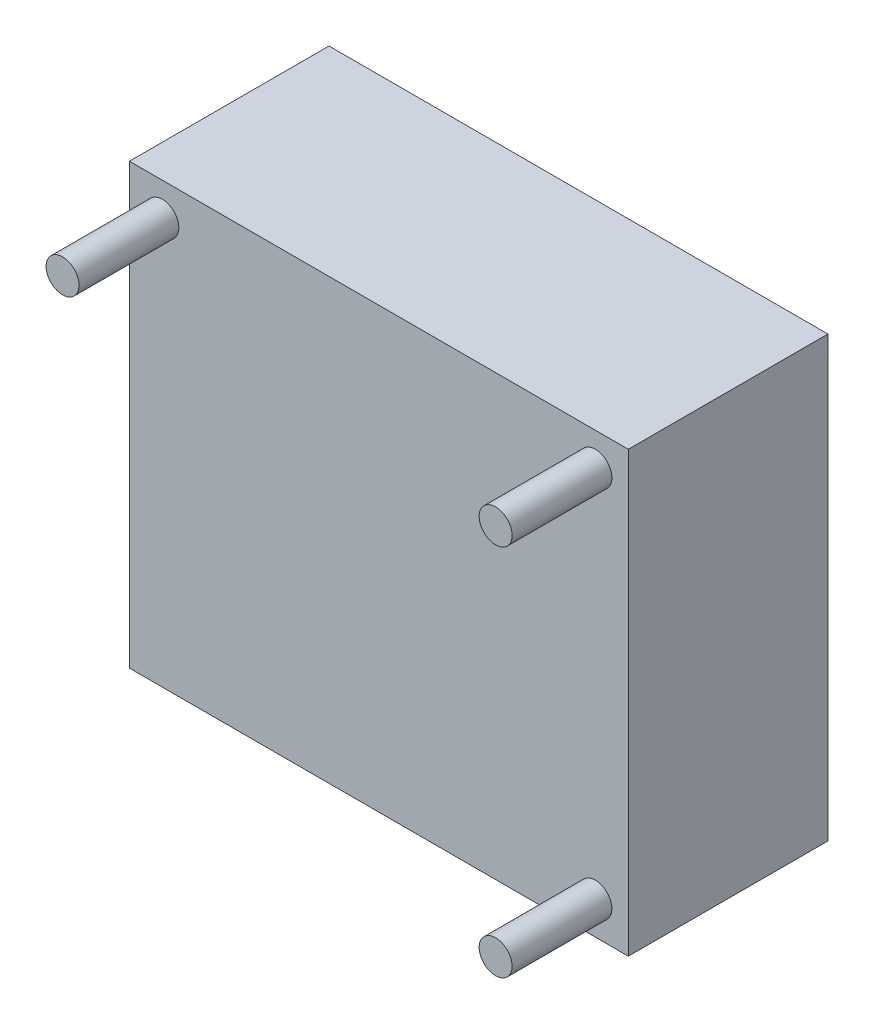
ISO-10303-21;
HEADER;
FILE_DESCRIPTION(('STEP AP214'),'2;1');
FILE_NAME('part.step','',(''),(''),'','','');
FILE_SCHEMA(('AUTOMOTIVE_DESIGN { 1 0 10303 214 1 1 1 1 }'));
ENDSEC;
DATA;
#1=APPLICATION_CONTEXT('core data for automotive mechanical design processes');
#2=APPLICATION_PROTOCOL_DEFINITION('international standard','automotive_design',2000,#1);
#3=PRODUCT_CONTEXT('',#1,'mechanical');
#4=PRODUCT('Part','Part','',(#3));
#5=PRODUCT_RELATED_PRODUCT_CATEGORY('part','',(#4));
#6=PRODUCT_DEFINITION_FORMATION('','',#4);
#7=PRODUCT_DEFINITION_CONTEXT('part definition',#1,'design');
#8=PRODUCT_DEFINITION('design','',#6,#7);
#9=PRODUCT_DEFINITION_SHAPE('','',#8);
#10=(LENGTH_UNIT() NAMED_UNIT(*) SI_UNIT(.MILLI.,.METRE.));
#11=(NAMED_UNIT(*) PLANE_ANGLE_UNIT() SI_UNIT($,.RADIAN.));
#12=(NAMED_UNIT(*) SI_UNIT($,.STERADIAN.) SOLID_ANGLE_UNIT());
#13=UNCERTAINTY_MEASURE_WITH_UNIT(LENGTH_MEASURE(1.E-05),#10,'distance_accuracy_value','');
#14=(GEOMETRIC_REPRESENTATION_CONTEXT(3) GLOBAL_UNCERTAINTY_ASSIGNED_CONTEXT((#13)) GLOBAL_UNIT_ASSIGNED_CONTEXT((#10,
#11,#12)) REPRESENTATION_CONTEXT('',''));
#15=CARTESIAN_POINT('',(0.,0.,0.));
#16=DIRECTION('',(0.,0.,1.));
#17=DIRECTION('',(1.,0.,0.));
#18=AXIS2_PLACEMENT_3D('',#15,#16,#17);
#19=CARTESIAN_POINT('',(3.3,40.7,30.));
#20=DIRECTION('',(0.,0.,-1.));
#21=DIRECTION('',(-1.,0.,0.));
#22=AXIS2_PLACEMENT_3D('',#19,#20,#21);
#23=CYLINDRICAL_SURFACE('',#22,1.65);
#24=CARTESIAN_POINT('',(3.3,40.7,30.));
#25=DIRECTION('',(0.,0.,-1.));
#26=DIRECTION('',(-1.,0.,0.));
#27=AXIS2_PLACEMENT_3D('',#24,#25,#26);
#28=CIRCLE('',#27,1.65);
#29=CARTESIAN_POINT('',(1.65,40.7,30.));
#30=VERTEX_POINT('',#29);
#31=EDGE_CURVE('E11',#30,#30,#28,.T.);
#32=ORIENTED_EDGE('',*,*,#31,.T.);
#33=EDGE_LOOP('',(#32));
#34=FACE_BOUND('',#33,.T.);
#35=CARTESIAN_POINT('',(3.3,40.7,0.));
#36=DIRECTION('',(0.,0.,-1.));
#37=DIRECTION('',(-1.,0.,0.));
#38=AXIS2_PLACEMENT_3D('',#35,#36,#37);
#39=CIRCLE('',#38,1.65);
#40=CARTESIAN_POINT('',(1.65,40.7,0.));
#41=VERTEX_POINT('',#40);
#42=EDGE_CURVE('E43',#41,#41,#39,.T.);
#43=ORIENTED_EDGE('',*,*,#42,.F.);
#44=EDGE_LOOP('',(#43));
#45=FACE_BOUND('',#44,.T.);
#46=ADVANCED_FACE('F40',(#34,#45),#23,.T.);
#47=CARTESIAN_POINT('',(3.3,40.7,30.));
#48=DIRECTION('',(0.,0.,-1.));
#49=DIRECTION('',(-1.,0.,0.));
#50=AXIS2_PLACEMENT_3D('',#47,#48,#49);
#51=PLANE('',#50);
#52=ORIENTED_EDGE('',*,*,#31,.F.);
#53=EDGE_LOOP('',(#52));
#54=FACE_BOUND('',#53,.T.);
#55=ADVANCED_FACE('F55',(#54),#51,.F.);
#56=CARTESIAN_POINT('',(3.3,40.7,0.));
#57=DIRECTION('',(0.,0.,-1.));
#58=DIRECTION('',(-1.,0.,0.));
#59=AXIS2_PLACEMENT_3D('',#56,#57,#58);
#60=PLANE('',#59);
#61=ORIENTED_EDGE('',*,*,#42,.T.);
#62=EDGE_LOOP('',(#61));
#63=FACE_BOUND('',#62,.T.);
#64=ADVANCED_FACE('F52',(#63),#60,.T.);
#65=CLOSED_SHELL('',(#46,#55,#64));
#66=MANIFOLD_SOLID_BREP('B2',#65);
#67=CARTESIAN_POINT('',(46.7,3.3,30.));
#68=DIRECTION('',(0.,0.,-1.));
#69=DIRECTION('',(-1.,0.,0.));
#70=AXIS2_PLACEMENT_3D('',#67,#68,#69);
#71=CYLINDRICAL_SURFACE('',#70,1.65);
#72=CARTESIAN_POINT('',(46.7,3.3,30.));
#73=DIRECTION('',(0.,0.,-1.));
#74=DIRECTION('',(-1.,0.,0.));
#75=AXIS2_PLACEMENT_3D('',#72,#73,#74);
#76=CIRCLE('',#75,1.65);
#77=CARTESIAN_POINT('',(45.05,3.3,30.));
#78=VERTEX_POINT('',#77);
#79=EDGE_CURVE('E39',#78,#78,#76,.T.);
#80=ORIENTED_EDGE('',*,*,#79,.T.);
#81=EDGE_LOOP('',(#80));
#82=FACE_BOUND('',#81,.T.);
#83=CARTESIAN_POINT('',(46.7,3.3,0.));
#84=DIRECTION('',(0.,0.,-1.));
#85=DIRECTION('',(-1.,0.,0.));
#86=AXIS2_PLACEMENT_3D('',#83,#84,#85);
#87=CIRCLE('',#86,1.65);
#88=CARTESIAN_POINT('',(45.05,3.3,0.));
#89=VERTEX_POINT('',#88);
#90=EDGE_CURVE('E92',#89,#89,#87,.T.);
#91=ORIENTED_EDGE('',*,*,#90,.F.);
#92=EDGE_LOOP('',(#91));
#93=FACE_BOUND('',#92,.T.);
#94=ADVANCED_FACE('F89',(#82,#93),#71,.T.);
#95=CARTESIAN_POINT('',(46.7,3.3,30.));
#96=DIRECTION('',(0.,0.,-1.));
#97=DIRECTION('',(-1.,0.,0.));
#98=AXIS2_PLACEMENT_3D('',#95,#96,#97);
#99=PLANE('',#98);
#100=ORIENTED_EDGE('',*,*,#79,.F.);
#101=EDGE_LOOP('',(#100));
#102=FACE_BOUND('',#101,.T.);
#103=ADVANCED_FACE('F104',(#102),#99,.F.);
#104=CARTESIAN_POINT('',(46.7,3.3,0.));
#105=DIRECTION('',(0.,0.,-1.));
#106=DIRECTION('',(-1.,0.,0.));
#107=AXIS2_PLACEMENT_3D('',#104,#105,#106);
#108=PLANE('',#107);
#109=ORIENTED_EDGE('',*,*,#90,.T.);
#110=EDGE_LOOP('',(#109));
#111=FACE_BOUND('',#110,.T.);
#112=ADVANCED_FACE('F101',(#111),#108,.T.);
#113=CLOSED_SHELL('',(#94,#103,#112));
#114=MANIFOLD_SOLID_BREP('B6',#113);
#115=CARTESIAN_POINT('',(46.7,40.7,30.));
#116=DIRECTION('',(0.,0.,-1.));
#117=DIRECTION('',(-1.,0.,0.));
#118=AXIS2_PLACEMENT_3D('',#115,#116,#117);
#119=CYLINDRICAL_SURFACE('',#118,1.65);
#120=CARTESIAN_POINT('',(46.7,40.7,30.));
#121=DIRECTION('',(0.,0.,-1.));
#122=DIRECTION('',(-1.,0.,0.));
#123=AXIS2_PLACEMENT_3D('',#120,#121,#122);
#124=CIRCLE('',#123,1.65);
#125=CARTESIAN_POINT('',(45.05,40.7,30.));
#126=VERTEX_POINT('',#125);
#127=EDGE_CURVE('E88',#126,#126,#124,.T.);
#128=ORIENTED_EDGE('',*,*,#127,.T.);
#129=EDGE_LOOP('',(#128));
#130=FACE_BOUND('',#129,.T.);
#131=CARTESIAN_POINT('',(46.7,40.7,0.));
#132=DIRECTION('',(0.,0.,-1.));
#133=DIRECTION('',(-1.,0.,0.));
#134=AXIS2_PLACEMENT_3D('',#131,#132,#133);
#135=CIRCLE('',#134,1.65);
#136=CARTESIAN_POINT('',(45.05,40.7,0.));
#137=VERTEX_POINT('',#136);
#138=EDGE_CURVE('E142',#137,#137,#135,.T.);
#139=ORIENTED_EDGE('',*,*,#138,.F.);
#140=EDGE_LOOP('',(#139));
#141=FACE_BOUND('',#140,.T.);
#142=ADVANCED_FACE('F139',(#130,#141),#119,.T.);
#143=CARTESIAN_POINT('',(46.7,40.7,30.));
#144=DIRECTION('',(0.,0.,-1.));
#145=DIRECTION('',(-1.,0.,0.));
#146=AXIS2_PLACEMENT_3D('',#143,#144,#145);
#147=PLANE('',#146);
#148=ORIENTED_EDGE('',*,*,#127,.F.);
#149=EDGE_LOOP('',(#148));
#150=FACE_BOUND('',#149,.T.);
#151=ADVANCED_FACE('F154',(#150),#147,.F.);
#152=CARTESIAN_POINT('',(46.7,40.7,0.));
#153=DIRECTION('',(0.,0.,-1.));
#154=DIRECTION('',(-1.,0.,0.));
#155=AXIS2_PLACEMENT_3D('',#152,#153,#154);
#156=PLANE('',#155);
#157=ORIENTED_EDGE('',*,*,#138,.T.);
#158=EDGE_LOOP('',(#157));
#159=FACE_BOUND('',#158,.T.);
#160=ADVANCED_FACE('F151',(#159),#156,.T.);
#161=CLOSED_SHELL('',(#142,#151,#160));
#162=MANIFOLD_SOLID_BREP('B34',#161);
#163=CARTESIAN_POINT('',(0.,44.,20.));
#164=DIRECTION('',(0.,0.,-1.));
#165=DIRECTION('',(-1.,0.,0.));
#166=AXIS2_PLACEMENT_3D('',#163,#164,#165);
#167=PLANE('',#166);
#168=CARTESIAN_POINT('',(3.3,40.7,20.));
#169=DIRECTION('',(0.,0.,1.));
#170=DIRECTION('',(-1.,0.,0.));
#171=AXIS2_PLACEMENT_3D('',#168,#169,#170);
#172=CIRCLE('',#171,1.65);
#173=CARTESIAN_POINT('',(1.65,40.7,20.));
#174=VERTEX_POINT('',#173);
#175=EDGE_CURVE('E261',#174,#174,#172,.T.);
#176=ORIENTED_EDGE('',*,*,#175,.F.);
#177=EDGE_LOOP('',(#176));
#178=FACE_BOUND('',#177,.T.);
#179=DIRECTION('',(0.,-1.,0.));
#180=VECTOR('',#179,1.);
#181=CARTESIAN_POINT('',(0.,0.,20.));
#182=LINE('',#181,#180);
#183=CARTESIAN_POINT('',(0.,44.,20.));
#184=VERTEX_POINT('',#183);
#185=CARTESIAN_POINT('',(0.,0.,20.));
#186=VERTEX_POINT('',#185);
#187=EDGE_CURVE('E231',#184,#186,#182,.T.);
#188=ORIENTED_EDGE('',*,*,#187,.T.);
#189=DIRECTION('',(1.,0.,0.));
#190=VECTOR('',#189,1.);
#191=CARTESIAN_POINT('',(0.,0.,20.));
#192=LINE('',#191,#190);
#193=CARTESIAN_POINT('',(50.,0.,20.));
#194=VERTEX_POINT('',#193);
#195=EDGE_CURVE('E226',#186,#194,#192,.T.);
#196=ORIENTED_EDGE('',*,*,#195,.T.);
#197=DIRECTION('',(0.,1.,0.));
#198=VECTOR('',#197,1.);
#199=CARTESIAN_POINT('',(50.,0.,20.));
#200=LINE('',#199,#198);
#201=CARTESIAN_POINT('',(50.,44.,20.));
#202=VERTEX_POINT('',#201);
#203=EDGE_CURVE('E229',#194,#202,#200,.T.);
#204=ORIENTED_EDGE('',*,*,#203,.T.);
#205=DIRECTION('',(-1.,0.,0.));
#206=VECTOR('',#205,1.);
#207=CARTESIAN_POINT('',(0.,44.,20.));
#208=LINE('',#207,#206);
#209=EDGE_CURVE('E196',#202,#184,#208,.T.);
#210=ORIENTED_EDGE('',*,*,#209,.T.);
#211=EDGE_LOOP('',(#188,#196,#204,#210));
#212=FACE_BOUND('',#211,.T.);
#213=CARTESIAN_POINT('',(46.7,40.7,20.));
#214=DIRECTION('',(0.,0.,1.));
#215=DIRECTION('',(1.,0.,0.));
#216=AXIS2_PLACEMENT_3D('',#213,#214,#215);
#217=CIRCLE('',#216,1.65);
#218=CARTESIAN_POINT('',(48.35,40.7,20.));
#219=VERTEX_POINT('',#218);
#220=EDGE_CURVE('E246',#219,#219,#217,.T.);
#221=ORIENTED_EDGE('',*,*,#220,.F.);
#222=EDGE_LOOP('',(#221));
#223=FACE_BOUND('',#222,.T.);
#224=CARTESIAN_POINT('',(46.7,3.3,20.));
#225=DIRECTION('',(0.,0.,1.));
#226=DIRECTION('',(-1.,0.,0.));
#227=AXIS2_PLACEMENT_3D('',#224,#225,#226);
#228=CIRCLE('',#227,1.65);
#229=CARTESIAN_POINT('',(45.05,3.3,20.));
#230=VERTEX_POINT('',#229);
#231=EDGE_CURVE('E267',#230,#230,#228,.T.);
#232=ORIENTED_EDGE('',*,*,#231,.F.);
#233=EDGE_LOOP('',(#232));
#234=FACE_BOUND('',#233,.T.);
#235=ADVANCED_FACE('F179',(#178,#212,#223,#234),#167,.F.);
#236=CARTESIAN_POINT('',(0.,44.,0.));
#237=DIRECTION('',(0.,0.,-1.));
#238=DIRECTION('',(-1.,0.,0.));
#239=AXIS2_PLACEMENT_3D('',#236,#237,#238);
#240=PLANE('',#239);
#241=CARTESIAN_POINT('',(3.3,40.7,0.));
#242=DIRECTION('',(0.,0.,1.));
#243=DIRECTION('',(-1.,0.,0.));
#244=AXIS2_PLACEMENT_3D('',#241,#242,#243);
#245=CIRCLE('',#244,1.65);
#246=CARTESIAN_POINT('',(1.65,40.7,0.));
#247=VERTEX_POINT('',#246);
#248=EDGE_CURVE('E264',#247,#247,#245,.T.);
#249=ORIENTED_EDGE('',*,*,#248,.T.);
#250=EDGE_LOOP('',(#249));
#251=FACE_BOUND('',#250,.T.);
#252=DIRECTION('',(0.,-1.,0.));
#253=VECTOR('',#252,1.);
#254=CARTESIAN_POINT('',(0.,0.,0.));
#255=LINE('',#254,#253);
#256=CARTESIAN_POINT('',(0.,44.,0.));
#257=VERTEX_POINT('',#256);
#258=CARTESIAN_POINT('',(0.,0.,0.));
#259=VERTEX_POINT('',#258);
#260=EDGE_CURVE('E243',#257,#259,#255,.T.);
#261=ORIENTED_EDGE('',*,*,#260,.F.);
#262=DIRECTION('',(-1.,0.,0.));
#263=VECTOR('',#262,1.);
#264=CARTESIAN_POINT('',(0.,44.,0.));
#265=LINE('',#264,#263);
#266=CARTESIAN_POINT('',(50.,44.,0.));
#267=VERTEX_POINT('',#266);
#268=EDGE_CURVE('E219',#267,#257,#265,.T.);
#269=ORIENTED_EDGE('',*,*,#268,.F.);
#270=DIRECTION('',(0.,1.,0.));
#271=VECTOR('',#270,1.);
#272=CARTESIAN_POINT('',(50.,0.,0.));
#273=LINE('',#272,#271);
#274=CARTESIAN_POINT('',(50.,0.,0.));
#275=VERTEX_POINT('',#274);
#276=EDGE_CURVE('E213',#275,#267,#273,.T.);
#277=ORIENTED_EDGE('',*,*,#276,.F.);
#278=DIRECTION('',(1.,0.,0.));
#279=VECTOR('',#278,1.);
#280=CARTESIAN_POINT('',(0.,0.,0.));
#281=LINE('',#280,#279);
#282=EDGE_CURVE('E235',#259,#275,#281,.T.);
#283=ORIENTED_EDGE('',*,*,#282,.F.);
#284=EDGE_LOOP('',(#261,#269,#277,#283));
#285=FACE_BOUND('',#284,.T.);
#286=CARTESIAN_POINT('',(46.7,40.7,0.));
#287=DIRECTION('',(0.,0.,1.));
#288=DIRECTION('',(1.,0.,0.));
#289=AXIS2_PLACEMENT_3D('',#286,#287,#288);
#290=CIRCLE('',#289,1.65);
#291=CARTESIAN_POINT('',(48.35,40.7,0.));
#292=VERTEX_POINT('',#291);
#293=EDGE_CURVE('E258',#292,#292,#290,.T.);
#294=ORIENTED_EDGE('',*,*,#293,.T.);
#295=EDGE_LOOP('',(#294));
#296=FACE_BOUND('',#295,.T.);
#297=CARTESIAN_POINT('',(46.7,3.3,0.));
#298=DIRECTION('',(0.,0.,1.));
#299=DIRECTION('',(-1.,0.,0.));
#300=AXIS2_PLACEMENT_3D('',#297,#298,#299);
#301=CIRCLE('',#300,1.65);
#302=CARTESIAN_POINT('',(45.05,3.3,0.));
#303=VERTEX_POINT('',#302);
#304=EDGE_CURVE('E270',#303,#303,#301,.T.);
#305=ORIENTED_EDGE('',*,*,#304,.T.);
#306=EDGE_LOOP('',(#305));
#307=FACE_BOUND('',#306,.T.);
#308=ADVANCED_FACE('F254',(#251,#285,#296,#307),#240,.T.);
#309=CARTESIAN_POINT('',(0.,0.,20.));
#310=DIRECTION('',(1.,0.,0.));
#311=DIRECTION('',(0.,0.,-1.));
#312=AXIS2_PLACEMENT_3D('',#309,#310,#311);
#313=PLANE('',#312);
#314=ORIENTED_EDGE('',*,*,#260,.T.);
#315=DIRECTION('',(0.,0.,-1.));
#316=VECTOR('',#315,1.);
#317=CARTESIAN_POINT('',(0.,0.,20.));
#318=LINE('',#317,#316);
#319=EDGE_CURVE('E137',#186,#259,#318,.T.);
#320=ORIENTED_EDGE('',*,*,#319,.F.);
#321=ORIENTED_EDGE('',*,*,#187,.F.);
#322=DIRECTION('',(0.,0.,-1.));
#323=VECTOR('',#322,1.);
#324=CARTESIAN_POINT('',(0.,44.,20.));
#325=LINE('',#324,#323);
#326=EDGE_CURVE('E239',#184,#257,#325,.T.);
#327=ORIENTED_EDGE('',*,*,#326,.T.);
#328=EDGE_LOOP('',(#314,#320,#321,#327));
#329=FACE_BOUND('',#328,.T.);
#330=ADVANCED_FACE('F181',(#329),#313,.F.);
#331=CARTESIAN_POINT('',(0.,0.,20.));
#332=DIRECTION('',(0.,1.,0.));
#333=DIRECTION('',(0.,0.,1.));
#334=AXIS2_PLACEMENT_3D('',#331,#332,#333);
#335=PLANE('',#334);
#336=ORIENTED_EDGE('',*,*,#282,.T.);
#337=DIRECTION('',(0.,0.,-1.));
#338=VECTOR('',#337,1.);
#339=CARTESIAN_POINT('',(50.,0.,20.));
#340=LINE('',#339,#338);
#341=EDGE_CURVE('E188',#194,#275,#340,.T.);
#342=ORIENTED_EDGE('',*,*,#341,.F.);
#343=ORIENTED_EDGE('',*,*,#195,.F.);
#344=ORIENTED_EDGE('',*,*,#319,.T.);
#345=EDGE_LOOP('',(#336,#342,#343,#344));
#346=FACE_BOUND('',#345,.T.);
#347=ADVANCED_FACE('F234',(#346),#335,.F.);
#348=CARTESIAN_POINT('',(50.,0.,20.));
#349=DIRECTION('',(-1.,0.,0.));
#350=DIRECTION('',(0.,0.,1.));
#351=AXIS2_PLACEMENT_3D('',#348,#349,#350);
#352=PLANE('',#351);
#353=ORIENTED_EDGE('',*,*,#276,.T.);
#354=DIRECTION('',(0.,0.,-1.));
#355=VECTOR('',#354,1.);
#356=CARTESIAN_POINT('',(50.,44.,20.));
#357=LINE('',#356,#355);
#358=EDGE_CURVE('E236',#202,#267,#357,.T.);
#359=ORIENTED_EDGE('',*,*,#358,.F.);
#360=ORIENTED_EDGE('',*,*,#203,.F.);
#361=ORIENTED_EDGE('',*,*,#341,.T.);
#362=EDGE_LOOP('',(#353,#359,#360,#361));
#363=FACE_BOUND('',#362,.T.);
#364=ADVANCED_FACE('F237',(#363),#352,.F.);
#365=CARTESIAN_POINT('',(0.,44.,20.));
#366=DIRECTION('',(0.,-1.,0.));
#367=DIRECTION('',(0.,0.,-1.));
#368=AXIS2_PLACEMENT_3D('',#365,#366,#367);
#369=PLANE('',#368);
#370=ORIENTED_EDGE('',*,*,#268,.T.);
#371=ORIENTED_EDGE('',*,*,#326,.F.);
#372=ORIENTED_EDGE('',*,*,#209,.F.);
#373=ORIENTED_EDGE('',*,*,#358,.T.);
#374=EDGE_LOOP('',(#370,#371,#372,#373));
#375=FACE_BOUND('',#374,.T.);
#376=ADVANCED_FACE('F251',(#375),#369,.F.);
#377=CARTESIAN_POINT('',(46.7,40.7,20.));
#378=DIRECTION('',(0.,0.,-1.));
#379=DIRECTION('',(-1.,0.,0.));
#380=AXIS2_PLACEMENT_3D('',#377,#378,#379);
#381=CYLINDRICAL_SURFACE('',#380,1.65);
#382=ORIENTED_EDGE('',*,*,#220,.T.);
#383=EDGE_LOOP('',(#382));
#384=FACE_BOUND('',#383,.T.);
#385=ORIENTED_EDGE('',*,*,#293,.F.);
#386=EDGE_LOOP('',(#385));
#387=FACE_BOUND('',#386,.T.);
#388=ADVANCED_FACE('F289',(#384,#387),#381,.F.);
#389=CARTESIAN_POINT('',(3.3,40.7,20.));
#390=DIRECTION('',(0.,0.,-1.));
#391=DIRECTION('',(-1.,0.,0.));
#392=AXIS2_PLACEMENT_3D('',#389,#390,#391);
#393=CYLINDRICAL_SURFACE('',#392,1.65);
#394=ORIENTED_EDGE('',*,*,#175,.T.);
#395=EDGE_LOOP('',(#394));
#396=FACE_BOUND('',#395,.T.);
#397=ORIENTED_EDGE('',*,*,#248,.F.);
#398=EDGE_LOOP('',(#397));
#399=FACE_BOUND('',#398,.T.);
#400=ADVANCED_FACE('F335',(#396,#399),#393,.F.);
#401=CARTESIAN_POINT('',(46.7,3.3,20.));
#402=DIRECTION('',(0.,0.,-1.));
#403=DIRECTION('',(-1.,0.,0.));
#404=AXIS2_PLACEMENT_3D('',#401,#402,#403);
#405=CYLINDRICAL_SURFACE('',#404,1.65);
#406=ORIENTED_EDGE('',*,*,#231,.T.);
#407=EDGE_LOOP('',(#406));
#408=FACE_BOUND('',#407,.T.);
#409=ORIENTED_EDGE('',*,*,#304,.F.);
#410=EDGE_LOOP('',(#409));
#411=FACE_BOUND('',#410,.T.);
#412=ADVANCED_FACE('F276',(#408,#411),#405,.F.);
#413=CLOSED_SHELL('',(#235,#308,#330,#347,#364,#376,#388,#400,#412));
#414=MANIFOLD_SOLID_BREP('B83',#413);
#415=ADVANCED_BREP_SHAPE_REPRESENTATION('',(#18,#66,#114,#162,#414),#14);
#416=SHAPE_DEFINITION_REPRESENTATION(#9,#415);
ENDSEC;
END-ISO-10303-21;
